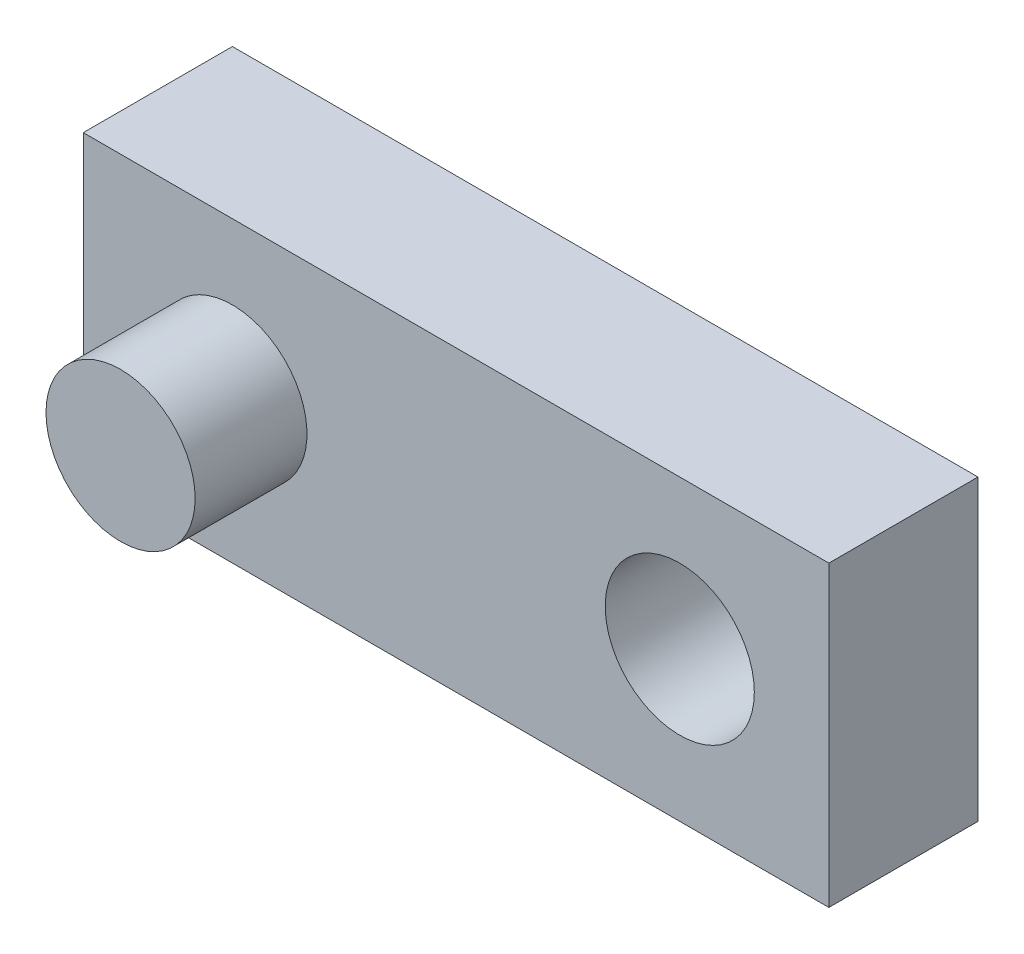
ISO-10303-21;
HEADER;
FILE_DESCRIPTION(('STEP AP214'),'2;1');
FILE_NAME('part.step','',(''),(''),'','','');
FILE_SCHEMA(('AUTOMOTIVE_DESIGN { 1 0 10303 214 1 1 1 1 }'));
ENDSEC;
DATA;
#1=APPLICATION_CONTEXT('core data for automotive mechanical design processes');
#2=APPLICATION_PROTOCOL_DEFINITION('international standard','automotive_design',2000,#1);
#3=PRODUCT_CONTEXT('',#1,'mechanical');
#4=PRODUCT('Part','Part','',(#3));
#5=PRODUCT_RELATED_PRODUCT_CATEGORY('part','',(#4));
#6=PRODUCT_DEFINITION_FORMATION('','',#4);
#7=PRODUCT_DEFINITION_CONTEXT('part definition',#1,'design');
#8=PRODUCT_DEFINITION('design','',#6,#7);
#9=PRODUCT_DEFINITION_SHAPE('','',#8);
#10=(LENGTH_UNIT() NAMED_UNIT(*) SI_UNIT(.MILLI.,.METRE.));
#11=(NAMED_UNIT(*) PLANE_ANGLE_UNIT() SI_UNIT($,.RADIAN.));
#12=(NAMED_UNIT(*) SI_UNIT($,.STERADIAN.) SOLID_ANGLE_UNIT());
#13=UNCERTAINTY_MEASURE_WITH_UNIT(LENGTH_MEASURE(1.E-05),#10,'distance_accuracy_value','');
#14=(GEOMETRIC_REPRESENTATION_CONTEXT(3) GLOBAL_UNCERTAINTY_ASSIGNED_CONTEXT((#13)) GLOBAL_UNIT_ASSIGNED_CONTEXT((#10,
#11,#12)) REPRESENTATION_CONTEXT('',''));
#15=CARTESIAN_POINT('',(0.,0.,0.));
#16=DIRECTION('',(0.,0.,1.));
#17=DIRECTION('',(1.,0.,0.));
#18=AXIS2_PLACEMENT_3D('',#15,#16,#17);
#19=CARTESIAN_POINT('',(1270.,508.,508.));
#20=DIRECTION('',(0.,0.,-1.));
#21=DIRECTION('',(-1.,0.,0.));
#22=AXIS2_PLACEMENT_3D('',#19,#20,#21);
#23=PLANE('',#22);
#24=CARTESIAN_POINT('',(762.,0.,508.));
#25=DIRECTION('',(0.,0.,1.));
#26=DIRECTION('',(1.,0.,0.));
#27=AXIS2_PLACEMENT_3D('',#24,#25,#26);
#28=CIRCLE('',#27,254.);
#29=CARTESIAN_POINT('',(1016.,0.,508.));
#30=VERTEX_POINT('',#29);
#31=EDGE_CURVE('E144',#30,#30,#28,.T.);
#32=ORIENTED_EDGE('',*,*,#31,.F.);
#33=EDGE_LOOP('',(#32));
#34=FACE_BOUND('',#33,.T.);
#35=DIRECTION('',(0.,1.,0.));
#36=VECTOR('',#35,1.);
#37=CARTESIAN_POINT('',(1270.,-508.,508.));
#38=LINE('',#37,#36);
#39=CARTESIAN_POINT('',(1270.,-508.,508.));
#40=VERTEX_POINT('',#39);
#41=CARTESIAN_POINT('',(1270.,508.,508.));
#42=VERTEX_POINT('',#41);
#43=EDGE_CURVE('E84',#40,#42,#38,.T.);
#44=ORIENTED_EDGE('',*,*,#43,.T.);
#45=DIRECTION('',(-1.,0.,0.));
#46=VECTOR('',#45,1.);
#47=CARTESIAN_POINT('',(-1270.,508.,508.));
#48=LINE('',#47,#46);
#49=CARTESIAN_POINT('',(-1270.,508.,508.));
#50=VERTEX_POINT('',#49);
#51=EDGE_CURVE('E79',#42,#50,#48,.T.);
#52=ORIENTED_EDGE('',*,*,#51,.T.);
#53=DIRECTION('',(0.,-1.,0.));
#54=VECTOR('',#53,1.);
#55=CARTESIAN_POINT('',(-1270.,-508.,508.));
#56=LINE('',#55,#54);
#57=CARTESIAN_POINT('',(-1270.,-508.,508.));
#58=VERTEX_POINT('',#57);
#59=EDGE_CURVE('E82',#50,#58,#56,.T.);
#60=ORIENTED_EDGE('',*,*,#59,.T.);
#61=DIRECTION('',(1.,0.,0.));
#62=VECTOR('',#61,1.);
#63=CARTESIAN_POINT('',(-1270.,-508.,508.));
#64=LINE('',#63,#62);
#65=EDGE_CURVE('E48',#58,#40,#64,.T.);
#66=ORIENTED_EDGE('',*,*,#65,.T.);
#67=EDGE_LOOP('',(#44,#52,#60,#66));
#68=FACE_BOUND('',#67,.T.);
#69=CARTESIAN_POINT('',(-762.,0.,508.));
#70=DIRECTION('',(0.,0.,-1.));
#71=DIRECTION('',(-1.,0.,0.));
#72=AXIS2_PLACEMENT_3D('',#69,#70,#71);
#73=CIRCLE('',#72,254.);
#74=CARTESIAN_POINT('',(-1016.,0.,508.));
#75=VERTEX_POINT('',#74);
#76=EDGE_CURVE('E11',#75,#75,#73,.F.);
#77=ORIENTED_EDGE('',*,*,#76,.F.);
#78=EDGE_LOOP('',(#77));
#79=FACE_BOUND('',#78,.T.);
#80=ADVANCED_FACE('F31',(#34,#68,#79),#23,.F.);
#81=CARTESIAN_POINT('',(1270.,-508.,508.));
#82=DIRECTION('',(-1.,0.,0.));
#83=DIRECTION('',(0.,0.,1.));
#84=AXIS2_PLACEMENT_3D('',#81,#82,#83);
#85=PLANE('',#84);
#86=DIRECTION('',(0.,1.,0.));
#87=VECTOR('',#86,1.);
#88=CARTESIAN_POINT('',(1270.,-508.,0.));
#89=LINE('',#88,#87);
#90=CARTESIAN_POINT('',(1270.,-508.,0.));
#91=VERTEX_POINT('',#90);
#92=CARTESIAN_POINT('',(1270.,508.,0.));
#93=VERTEX_POINT('',#92);
#94=EDGE_CURVE('E98',#91,#93,#89,.T.);
#95=ORIENTED_EDGE('',*,*,#94,.T.);
#96=DIRECTION('',(0.,0.,-1.));
#97=VECTOR('',#96,1.);
#98=CARTESIAN_POINT('',(1270.,508.,508.));
#99=LINE('',#98,#97);
#100=EDGE_CURVE('E40',#42,#93,#99,.T.);
#101=ORIENTED_EDGE('',*,*,#100,.F.);
#102=ORIENTED_EDGE('',*,*,#43,.F.);
#103=DIRECTION('',(0.,0.,-1.));
#104=VECTOR('',#103,1.);
#105=CARTESIAN_POINT('',(1270.,-508.,508.));
#106=LINE('',#105,#104);
#107=EDGE_CURVE('E94',#40,#91,#106,.T.);
#108=ORIENTED_EDGE('',*,*,#107,.T.);
#109=EDGE_LOOP('',(#95,#101,#102,#108));
#110=FACE_BOUND('',#109,.T.);
#111=ADVANCED_FACE('F33',(#110),#85,.F.);
#112=CARTESIAN_POINT('',(-1270.,508.,508.));
#113=DIRECTION('',(0.,-1.,0.));
#114=DIRECTION('',(0.,0.,-1.));
#115=AXIS2_PLACEMENT_3D('',#112,#113,#114);
#116=PLANE('',#115);
#117=DIRECTION('',(-1.,0.,0.));
#118=VECTOR('',#117,1.);
#119=CARTESIAN_POINT('',(-1270.,508.,0.));
#120=LINE('',#119,#118);
#121=CARTESIAN_POINT('',(-1270.,508.,0.));
#122=VERTEX_POINT('',#121);
#123=EDGE_CURVE('E89',#93,#122,#120,.T.);
#124=ORIENTED_EDGE('',*,*,#123,.T.);
#125=DIRECTION('',(0.,0.,-1.));
#126=VECTOR('',#125,1.);
#127=CARTESIAN_POINT('',(-1270.,508.,508.));
#128=LINE('',#127,#126);
#129=EDGE_CURVE('E87',#50,#122,#128,.T.);
#130=ORIENTED_EDGE('',*,*,#129,.F.);
#131=ORIENTED_EDGE('',*,*,#51,.F.);
#132=ORIENTED_EDGE('',*,*,#100,.T.);
#133=EDGE_LOOP('',(#124,#130,#131,#132));
#134=FACE_BOUND('',#133,.T.);
#135=ADVANCED_FACE('F88',(#134),#116,.F.);
#136=CARTESIAN_POINT('',(-1270.,-508.,508.));
#137=DIRECTION('',(1.,0.,0.));
#138=DIRECTION('',(0.,0.,-1.));
#139=AXIS2_PLACEMENT_3D('',#136,#137,#138);
#140=PLANE('',#139);
#141=DIRECTION('',(0.,-1.,0.));
#142=VECTOR('',#141,1.);
#143=CARTESIAN_POINT('',(-1270.,-508.,0.));
#144=LINE('',#143,#142);
#145=CARTESIAN_POINT('',(-1270.,-508.,0.));
#146=VERTEX_POINT('',#145);
#147=EDGE_CURVE('E65',#122,#146,#144,.T.);
#148=ORIENTED_EDGE('',*,*,#147,.T.);
#149=DIRECTION('',(0.,0.,-1.));
#150=VECTOR('',#149,1.);
#151=CARTESIAN_POINT('',(-1270.,-508.,508.));
#152=LINE('',#151,#150);
#153=EDGE_CURVE('E90',#58,#146,#152,.T.);
#154=ORIENTED_EDGE('',*,*,#153,.F.);
#155=ORIENTED_EDGE('',*,*,#59,.F.);
#156=ORIENTED_EDGE('',*,*,#129,.T.);
#157=EDGE_LOOP('',(#148,#154,#155,#156));
#158=FACE_BOUND('',#157,.T.);
#159=ADVANCED_FACE('F92',(#158),#140,.F.);
#160=CARTESIAN_POINT('',(-1270.,-508.,508.));
#161=DIRECTION('',(0.,1.,0.));
#162=DIRECTION('',(0.,0.,1.));
#163=AXIS2_PLACEMENT_3D('',#160,#161,#162);
#164=PLANE('',#163);
#165=DIRECTION('',(1.,0.,0.));
#166=VECTOR('',#165,1.);
#167=CARTESIAN_POINT('',(-1270.,-508.,0.));
#168=LINE('',#167,#166);
#169=EDGE_CURVE('E71',#146,#91,#168,.T.);
#170=ORIENTED_EDGE('',*,*,#169,.T.);
#171=ORIENTED_EDGE('',*,*,#107,.F.);
#172=ORIENTED_EDGE('',*,*,#65,.F.);
#173=ORIENTED_EDGE('',*,*,#153,.T.);
#174=EDGE_LOOP('',(#170,#171,#172,#173));
#175=FACE_BOUND('',#174,.T.);
#176=ADVANCED_FACE('F112',(#175),#164,.F.);
#177=CARTESIAN_POINT('',(1270.,508.,0.));
#178=DIRECTION('',(0.,0.,-1.));
#179=DIRECTION('',(-1.,0.,0.));
#180=AXIS2_PLACEMENT_3D('',#177,#178,#179);
#181=PLANE('',#180);
#182=CARTESIAN_POINT('',(762.,0.,0.));
#183=DIRECTION('',(0.,0.,1.));
#184=DIRECTION('',(1.,0.,0.));
#185=AXIS2_PLACEMENT_3D('',#182,#183,#184);
#186=CIRCLE('',#185,254.);
#187=CARTESIAN_POINT('',(1016.,0.,0.));
#188=VERTEX_POINT('',#187);
#189=EDGE_CURVE('E142',#188,#188,#186,.T.);
#190=ORIENTED_EDGE('',*,*,#189,.T.);
#191=EDGE_LOOP('',(#190));
#192=FACE_BOUND('',#191,.T.);
#193=ORIENTED_EDGE('',*,*,#94,.F.);
#194=ORIENTED_EDGE('',*,*,#169,.F.);
#195=ORIENTED_EDGE('',*,*,#147,.F.);
#196=ORIENTED_EDGE('',*,*,#123,.F.);
#197=EDGE_LOOP('',(#193,#194,#195,#196));
#198=FACE_BOUND('',#197,.T.);
#199=ADVANCED_FACE('F109',(#192,#198),#181,.T.);
#200=CARTESIAN_POINT('',(-762.,0.,889.));
#201=DIRECTION('',(0.,0.,-1.));
#202=DIRECTION('',(-1.,0.,0.));
#203=AXIS2_PLACEMENT_3D('',#200,#201,#202);
#204=CYLINDRICAL_SURFACE('',#203,254.);
#205=CARTESIAN_POINT('',(-762.,0.,889.));
#206=DIRECTION('',(0.,0.,1.));
#207=DIRECTION('',(1.,0.,0.));
#208=AXIS2_PLACEMENT_3D('',#205,#206,#207);
#209=CIRCLE('',#208,254.);
#210=CARTESIAN_POINT('',(-508.,0.,889.));
#211=VERTEX_POINT('',#210);
#212=EDGE_CURVE('E101',#211,#211,#209,.T.);
#213=ORIENTED_EDGE('',*,*,#212,.F.);
#214=EDGE_LOOP('',(#213));
#215=FACE_BOUND('',#214,.T.);
#216=ORIENTED_EDGE('',*,*,#76,.T.);
#217=EDGE_LOOP('',(#216));
#218=FACE_BOUND('',#217,.T.);
#219=ADVANCED_FACE('F111',(#215,#218),#204,.T.);
#220=CARTESIAN_POINT('',(-762.,0.,889.));
#221=DIRECTION('',(0.,0.,1.));
#222=DIRECTION('',(1.,0.,0.));
#223=AXIS2_PLACEMENT_3D('',#220,#221,#222);
#224=PLANE('',#223);
#225=ORIENTED_EDGE('',*,*,#212,.T.);
#226=EDGE_LOOP('',(#225));
#227=FACE_BOUND('',#226,.T.);
#228=ADVANCED_FACE('F119',(#227),#224,.T.);
#229=CARTESIAN_POINT('',(762.,0.,0.));
#230=DIRECTION('',(0.,0.,1.));
#231=DIRECTION('',(1.,0.,0.));
#232=AXIS2_PLACEMENT_3D('',#229,#230,#231);
#233=CYLINDRICAL_SURFACE('',#232,254.);
#234=ORIENTED_EDGE('',*,*,#189,.F.);
#235=EDGE_LOOP('',(#234));
#236=FACE_BOUND('',#235,.T.);
#237=ORIENTED_EDGE('',*,*,#31,.T.);
#238=EDGE_LOOP('',(#237));
#239=FACE_BOUND('',#238,.T.);
#240=ADVANCED_FACE('F134',(#236,#239),#233,.F.);
#241=CLOSED_SHELL('',(#80,#111,#135,#159,#176,#199,#219,#228,#240));
#242=MANIFOLD_SOLID_BREP('B2',#241);
#243=ADVANCED_BREP_SHAPE_REPRESENTATION('',(#18,#242),#14);
#244=SHAPE_DEFINITION_REPRESENTATION(#9,#243);
ENDSEC;
END-ISO-10303-21;
